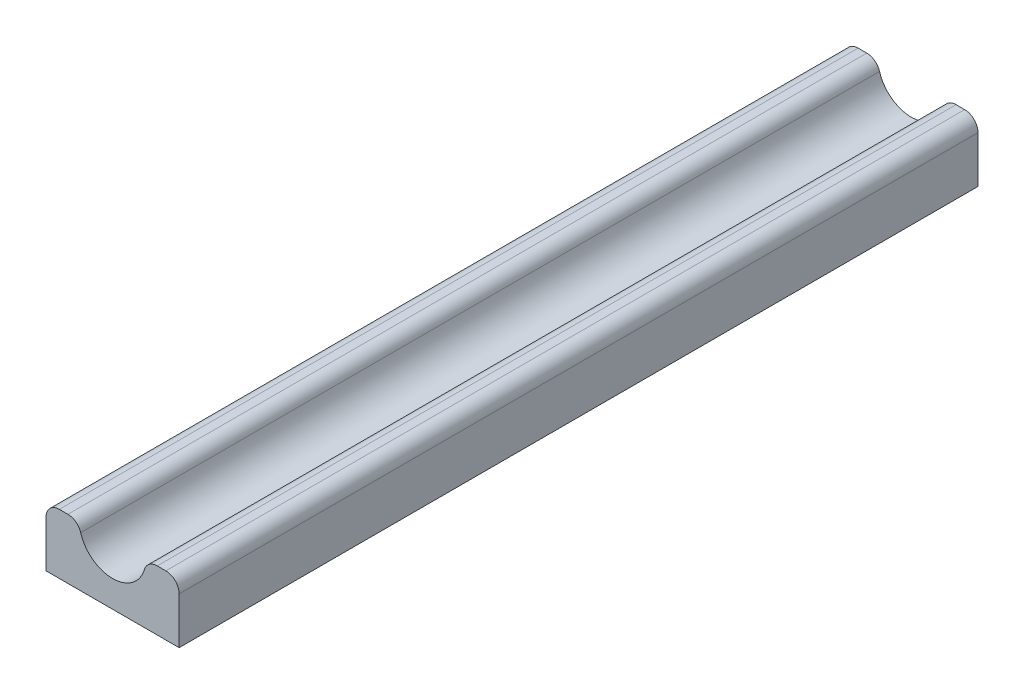
ISO-10303-21;
HEADER;
FILE_DESCRIPTION(('STEP AP214'),'2;1');
FILE_NAME('part.step','',(''),(''),'','','');
FILE_SCHEMA(('AUTOMOTIVE_DESIGN { 1 0 10303 214 1 1 1 1 }'));
ENDSEC;
DATA;
#1=APPLICATION_CONTEXT('core data for automotive mechanical design processes');
#2=APPLICATION_PROTOCOL_DEFINITION('international standard','automotive_design',2000,#1);
#3=PRODUCT_CONTEXT('',#1,'mechanical');
#4=PRODUCT('Part','Part','',(#3));
#5=PRODUCT_RELATED_PRODUCT_CATEGORY('part','',(#4));
#6=PRODUCT_DEFINITION_FORMATION('','',#4);
#7=PRODUCT_DEFINITION_CONTEXT('part definition',#1,'design');
#8=PRODUCT_DEFINITION('design','',#6,#7);
#9=PRODUCT_DEFINITION_SHAPE('','',#8);
#10=(LENGTH_UNIT() NAMED_UNIT(*) SI_UNIT(.MILLI.,.METRE.));
#11=(NAMED_UNIT(*) PLANE_ANGLE_UNIT() SI_UNIT($,.RADIAN.));
#12=(NAMED_UNIT(*) SI_UNIT($,.STERADIAN.) SOLID_ANGLE_UNIT());
#13=UNCERTAINTY_MEASURE_WITH_UNIT(LENGTH_MEASURE(1.E-05),#10,'distance_accuracy_value','');
#14=(GEOMETRIC_REPRESENTATION_CONTEXT(3) GLOBAL_UNCERTAINTY_ASSIGNED_CONTEXT((#13)) GLOBAL_UNIT_ASSIGNED_CONTEXT((#10,
#11,#12)) REPRESENTATION_CONTEXT('',''));
#15=CARTESIAN_POINT('',(0.,0.,0.));
#16=DIRECTION('',(0.,0.,1.));
#17=DIRECTION('',(1.,0.,0.));
#18=AXIS2_PLACEMENT_3D('',#15,#16,#17);
#19=CARTESIAN_POINT('',(25.,0.,300.));
#20=DIRECTION('',(-1.,0.,0.));
#21=DIRECTION('',(0.,-1.,0.));
#22=AXIS2_PLACEMENT_3D('',#19,#20,#21);
#23=PLANE('',#22);
#24=DIRECTION('',(0.,1.,0.));
#25=VECTOR('',#24,1.);
#26=CARTESIAN_POINT('',(25.,0.,0.));
#27=LINE('',#26,#25);
#28=CARTESIAN_POINT('',(25.,0.,0.));
#29=VERTEX_POINT('',#28);
#30=CARTESIAN_POINT('',(25.,17.5,0.));
#31=VERTEX_POINT('',#30);
#32=EDGE_CURVE('E143',#29,#31,#27,.T.);
#33=ORIENTED_EDGE('',*,*,#32,.T.);
#34=DIRECTION('',(0.,0.,-1.));
#35=VECTOR('',#34,1.);
#36=CARTESIAN_POINT('',(25.,17.5,300.));
#37=LINE('',#36,#35);
#38=CARTESIAN_POINT('',(25.,17.5,300.));
#39=VERTEX_POINT('',#38);
#40=EDGE_CURVE('E11',#39,#31,#37,.T.);
#41=ORIENTED_EDGE('',*,*,#40,.F.);
#42=DIRECTION('',(0.,1.,0.));
#43=VECTOR('',#42,1.);
#44=CARTESIAN_POINT('',(25.,0.,300.));
#45=LINE('',#44,#43);
#46=CARTESIAN_POINT('',(25.,0.,300.));
#47=VERTEX_POINT('',#46);
#48=EDGE_CURVE('E161',#47,#39,#45,.T.);
#49=ORIENTED_EDGE('',*,*,#48,.F.);
#50=DIRECTION('',(0.,0.,-1.));
#51=VECTOR('',#50,1.);
#52=CARTESIAN_POINT('',(25.,0.,300.));
#53=LINE('',#52,#51);
#54=EDGE_CURVE('E139',#47,#29,#53,.T.);
#55=ORIENTED_EDGE('',*,*,#54,.T.);
#56=EDGE_LOOP('',(#33,#41,#49,#55));
#57=FACE_BOUND('',#56,.T.);
#58=ADVANCED_FACE('F35',(#57),#23,.F.);
#59=CARTESIAN_POINT('',(20.,17.5,300.));
#60=DIRECTION('',(0.,0.,-1.));
#61=DIRECTION('',(-1.,0.,0.));
#62=AXIS2_PLACEMENT_3D('',#59,#60,#61);
#63=CYLINDRICAL_SURFACE('',#62,5.);
#64=CARTESIAN_POINT('',(20.,17.5,0.));
#65=DIRECTION('',(0.,0.,1.));
#66=DIRECTION('',(1.,0.,0.));
#67=AXIS2_PLACEMENT_3D('',#64,#65,#66);
#68=CIRCLE('',#67,5.);
#69=CARTESIAN_POINT('',(20.,22.5,0.));
#70=VERTEX_POINT('',#69);
#71=EDGE_CURVE('E146',#31,#70,#68,.T.);
#72=ORIENTED_EDGE('',*,*,#71,.T.);
#73=DIRECTION('',(0.,0.,-1.));
#74=VECTOR('',#73,1.);
#75=CARTESIAN_POINT('',(20.,22.5,300.));
#76=LINE('',#75,#74);
#77=CARTESIAN_POINT('',(20.,22.5,300.));
#78=VERTEX_POINT('',#77);
#79=EDGE_CURVE('E43',#78,#70,#76,.T.);
#80=ORIENTED_EDGE('',*,*,#79,.F.);
#81=CARTESIAN_POINT('',(20.,17.5,300.));
#82=DIRECTION('',(0.,0.,1.));
#83=DIRECTION('',(1.,0.,0.));
#84=AXIS2_PLACEMENT_3D('',#81,#82,#83);
#85=CIRCLE('',#84,5.);
#86=EDGE_CURVE('E100',#39,#78,#85,.T.);
#87=ORIENTED_EDGE('',*,*,#86,.F.);
#88=ORIENTED_EDGE('',*,*,#40,.T.);
#89=EDGE_LOOP('',(#72,#80,#87,#88));
#90=FACE_BOUND('',#89,.T.);
#91=ADVANCED_FACE('F210',(#90),#63,.T.);
#92=CARTESIAN_POINT('',(20.,22.5,300.));
#93=DIRECTION('',(0.,-1.,0.));
#94=DIRECTION('',(1.,0.,0.));
#95=AXIS2_PLACEMENT_3D('',#92,#93,#94);
#96=PLANE('',#95);
#97=DIRECTION('',(-1.,0.,0.));
#98=VECTOR('',#97,1.);
#99=CARTESIAN_POINT('',(20.,22.5,0.));
#100=LINE('',#99,#98);
#101=CARTESIAN_POINT('',(16.7705098312484,22.5,0.));
#102=VERTEX_POINT('',#101);
#103=EDGE_CURVE('E148',#70,#102,#100,.T.);
#104=ORIENTED_EDGE('',*,*,#103,.T.);
#105=DIRECTION('',(0.,0.,-1.));
#106=VECTOR('',#105,1.);
#107=CARTESIAN_POINT('',(16.7705098312484,22.5,300.));
#108=LINE('',#107,#106);
#109=CARTESIAN_POINT('',(16.7705098312484,22.5,300.));
#110=VERTEX_POINT('',#109);
#111=EDGE_CURVE('E174',#110,#102,#108,.T.);
#112=ORIENTED_EDGE('',*,*,#111,.F.);
#113=DIRECTION('',(-1.,0.,0.));
#114=VECTOR('',#113,1.);
#115=CARTESIAN_POINT('',(20.,22.5,300.));
#116=LINE('',#115,#114);
#117=EDGE_CURVE('E182',#78,#110,#116,.T.);
#118=ORIENTED_EDGE('',*,*,#117,.F.);
#119=ORIENTED_EDGE('',*,*,#79,.T.);
#120=EDGE_LOOP('',(#104,#112,#118,#119));
#121=FACE_BOUND('',#120,.T.);
#122=ADVANCED_FACE('F180',(#121),#96,.F.);
#123=CARTESIAN_POINT('',(16.7705098312484,17.5,300.));
#124=DIRECTION('',(0.,0.,-1.));
#125=DIRECTION('',(-1.,0.,0.));
#126=AXIS2_PLACEMENT_3D('',#123,#124,#125);
#127=CYLINDRICAL_SURFACE('',#126,5.);
#128=CARTESIAN_POINT('',(16.7705098312484,17.5,0.));
#129=DIRECTION('',(0.,0.,1.));
#130=DIRECTION('',(1.,0.,0.));
#131=AXIS2_PLACEMENT_3D('',#128,#129,#130);
#132=CIRCLE('',#131,5.);
#133=CARTESIAN_POINT('',(11.9789355937489,18.9285714285714,0.));
#134=VERTEX_POINT('',#133);
#135=EDGE_CURVE('E150',#102,#134,#132,.T.);
#136=ORIENTED_EDGE('',*,*,#135,.T.);
#137=DIRECTION('',(0.,0.,-1.));
#138=VECTOR('',#137,1.);
#139=CARTESIAN_POINT('',(11.9789355937489,18.9285714285714,300.));
#140=LINE('',#139,#138);
#141=CARTESIAN_POINT('',(11.9789355937489,18.9285714285714,300.));
#142=VERTEX_POINT('',#141);
#143=EDGE_CURVE('E171',#142,#134,#140,.T.);
#144=ORIENTED_EDGE('',*,*,#143,.F.);
#145=CARTESIAN_POINT('',(16.7705098312484,17.5,300.));
#146=DIRECTION('',(0.,0.,1.));
#147=DIRECTION('',(1.,0.,0.));
#148=AXIS2_PLACEMENT_3D('',#145,#146,#147);
#149=CIRCLE('',#148,5.);
#150=EDGE_CURVE('E200',#110,#142,#149,.T.);
#151=ORIENTED_EDGE('',*,*,#150,.F.);
#152=ORIENTED_EDGE('',*,*,#111,.T.);
#153=EDGE_LOOP('',(#136,#144,#151,#152));
#154=FACE_BOUND('',#153,.T.);
#155=ADVANCED_FACE('F191',(#154),#127,.T.);
#156=CARTESIAN_POINT('',(0.,22.5,300.));
#157=DIRECTION('',(0.,0.,-1.));
#158=DIRECTION('',(-1.,0.,0.));
#159=AXIS2_PLACEMENT_3D('',#156,#157,#158);
#160=CYLINDRICAL_SURFACE('',#159,12.5);
#161=CARTESIAN_POINT('',(0.,22.5,0.));
#162=DIRECTION('',(0.,0.,-1.));
#163=DIRECTION('',(1.,0.,0.));
#164=AXIS2_PLACEMENT_3D('',#161,#162,#163);
#165=CIRCLE('',#164,12.5);
#166=CARTESIAN_POINT('',(-11.9789355937489,18.9285714285714,0.));
#167=VERTEX_POINT('',#166);
#168=EDGE_CURVE('E152',#134,#167,#165,.T.);
#169=ORIENTED_EDGE('',*,*,#168,.T.);
#170=DIRECTION('',(0.,0.,-1.));
#171=VECTOR('',#170,1.);
#172=CARTESIAN_POINT('',(-11.9789355937489,18.9285714285714,300.));
#173=LINE('',#172,#171);
#174=CARTESIAN_POINT('',(-11.9789355937489,18.9285714285714,300.));
#175=VERTEX_POINT('',#174);
#176=EDGE_CURVE('E168',#175,#167,#173,.T.);
#177=ORIENTED_EDGE('',*,*,#176,.F.);
#178=CARTESIAN_POINT('',(0.,22.5,300.));
#179=DIRECTION('',(0.,0.,-1.));
#180=DIRECTION('',(1.,0.,0.));
#181=AXIS2_PLACEMENT_3D('',#178,#179,#180);
#182=CIRCLE('',#181,12.5);
#183=EDGE_CURVE('E197',#142,#175,#182,.T.);
#184=ORIENTED_EDGE('',*,*,#183,.F.);
#185=ORIENTED_EDGE('',*,*,#143,.T.);
#186=EDGE_LOOP('',(#169,#177,#184,#185));
#187=FACE_BOUND('',#186,.T.);
#188=ADVANCED_FACE('F195',(#187),#160,.F.);
#189=CARTESIAN_POINT('',(-16.7705098312484,17.5,300.));
#190=DIRECTION('',(0.,0.,-1.));
#191=DIRECTION('',(-1.,0.,0.));
#192=AXIS2_PLACEMENT_3D('',#189,#190,#191);
#193=CYLINDRICAL_SURFACE('',#192,5.);
#194=CARTESIAN_POINT('',(-16.7705098312484,17.5,0.));
#195=DIRECTION('',(0.,0.,1.));
#196=DIRECTION('',(-1.,0.,0.));
#197=AXIS2_PLACEMENT_3D('',#194,#195,#196);
#198=CIRCLE('',#197,5.);
#199=CARTESIAN_POINT('',(-16.7705098312484,22.5,0.));
#200=VERTEX_POINT('',#199);
#201=EDGE_CURVE('E154',#167,#200,#198,.T.);
#202=ORIENTED_EDGE('',*,*,#201,.T.);
#203=DIRECTION('',(0.,0.,-1.));
#204=VECTOR('',#203,1.);
#205=CARTESIAN_POINT('',(-16.7705098312484,22.5,300.));
#206=LINE('',#205,#204);
#207=CARTESIAN_POINT('',(-16.7705098312484,22.5,300.));
#208=VERTEX_POINT('',#207);
#209=EDGE_CURVE('E165',#208,#200,#206,.T.);
#210=ORIENTED_EDGE('',*,*,#209,.F.);
#211=CARTESIAN_POINT('',(-16.7705098312484,17.5,300.));
#212=DIRECTION('',(0.,0.,1.));
#213=DIRECTION('',(-1.,0.,0.));
#214=AXIS2_PLACEMENT_3D('',#211,#212,#213);
#215=CIRCLE('',#214,5.);
#216=EDGE_CURVE('E199',#175,#208,#215,.T.);
#217=ORIENTED_EDGE('',*,*,#216,.F.);
#218=ORIENTED_EDGE('',*,*,#176,.T.);
#219=EDGE_LOOP('',(#202,#210,#217,#218));
#220=FACE_BOUND('',#219,.T.);
#221=ADVANCED_FACE('F222',(#220),#193,.T.);
#222=CARTESIAN_POINT('',(-20.,22.5,300.));
#223=DIRECTION('',(0.,-1.,0.));
#224=DIRECTION('',(1.,0.,0.));
#225=AXIS2_PLACEMENT_3D('',#222,#223,#224);
#226=PLANE('',#225);
#227=DIRECTION('',(-1.,0.,0.));
#228=VECTOR('',#227,1.);
#229=CARTESIAN_POINT('',(-20.,22.5,0.));
#230=LINE('',#229,#228);
#231=CARTESIAN_POINT('',(-20.,22.5,0.));
#232=VERTEX_POINT('',#231);
#233=EDGE_CURVE('E156',#200,#232,#230,.T.);
#234=ORIENTED_EDGE('',*,*,#233,.T.);
#235=DIRECTION('',(0.,0.,-1.));
#236=VECTOR('',#235,1.);
#237=CARTESIAN_POINT('',(-20.,22.5,300.));
#238=LINE('',#237,#236);
#239=CARTESIAN_POINT('',(-20.,22.5,300.));
#240=VERTEX_POINT('',#239);
#241=EDGE_CURVE('E134',#240,#232,#238,.T.);
#242=ORIENTED_EDGE('',*,*,#241,.F.);
#243=DIRECTION('',(-1.,0.,0.));
#244=VECTOR('',#243,1.);
#245=CARTESIAN_POINT('',(-20.,22.5,300.));
#246=LINE('',#245,#244);
#247=EDGE_CURVE('E125',#208,#240,#246,.T.);
#248=ORIENTED_EDGE('',*,*,#247,.F.);
#249=ORIENTED_EDGE('',*,*,#209,.T.);
#250=EDGE_LOOP('',(#234,#242,#248,#249));
#251=FACE_BOUND('',#250,.T.);
#252=ADVANCED_FACE('F225',(#251),#226,.F.);
#253=CARTESIAN_POINT('',(-20.,17.5,300.));
#254=DIRECTION('',(0.,0.,-1.));
#255=DIRECTION('',(-1.,0.,0.));
#256=AXIS2_PLACEMENT_3D('',#253,#254,#255);
#257=CYLINDRICAL_SURFACE('',#256,5.);
#258=CARTESIAN_POINT('',(-20.,17.5,0.));
#259=DIRECTION('',(0.,0.,1.));
#260=DIRECTION('',(-1.,0.,0.));
#261=AXIS2_PLACEMENT_3D('',#258,#259,#260);
#262=CIRCLE('',#261,5.);
#263=CARTESIAN_POINT('',(-25.,17.5,0.));
#264=VERTEX_POINT('',#263);
#265=EDGE_CURVE('E133',#232,#264,#262,.T.);
#266=ORIENTED_EDGE('',*,*,#265,.T.);
#267=DIRECTION('',(0.,0.,-1.));
#268=VECTOR('',#267,1.);
#269=CARTESIAN_POINT('',(-25.,17.5,300.));
#270=LINE('',#269,#268);
#271=CARTESIAN_POINT('',(-25.,17.5,300.));
#272=VERTEX_POINT('',#271);
#273=EDGE_CURVE('E130',#272,#264,#270,.T.);
#274=ORIENTED_EDGE('',*,*,#273,.F.);
#275=CARTESIAN_POINT('',(-20.,17.5,300.));
#276=DIRECTION('',(0.,0.,1.));
#277=DIRECTION('',(-1.,0.,0.));
#278=AXIS2_PLACEMENT_3D('',#275,#276,#277);
#279=CIRCLE('',#278,5.);
#280=EDGE_CURVE('E119',#240,#272,#279,.T.);
#281=ORIENTED_EDGE('',*,*,#280,.F.);
#282=ORIENTED_EDGE('',*,*,#241,.T.);
#283=EDGE_LOOP('',(#266,#274,#281,#282));
#284=FACE_BOUND('',#283,.T.);
#285=ADVANCED_FACE('F131',(#284),#257,.T.);
#286=CARTESIAN_POINT('',(-25.,0.,300.));
#287=DIRECTION('',(1.,0.,0.));
#288=DIRECTION('',(0.,1.,0.));
#289=AXIS2_PLACEMENT_3D('',#286,#287,#288);
#290=PLANE('',#289);
#291=DIRECTION('',(0.,-1.,0.));
#292=VECTOR('',#291,1.);
#293=CARTESIAN_POINT('',(-25.,0.,0.));
#294=LINE('',#293,#292);
#295=CARTESIAN_POINT('',(-25.,0.,0.));
#296=VERTEX_POINT('',#295);
#297=EDGE_CURVE('E86',#264,#296,#294,.T.);
#298=ORIENTED_EDGE('',*,*,#297,.T.);
#299=DIRECTION('',(0.,0.,-1.));
#300=VECTOR('',#299,1.);
#301=CARTESIAN_POINT('',(-25.,0.,300.));
#302=LINE('',#301,#300);
#303=CARTESIAN_POINT('',(-25.,0.,300.));
#304=VERTEX_POINT('',#303);
#305=EDGE_CURVE('E135',#304,#296,#302,.T.);
#306=ORIENTED_EDGE('',*,*,#305,.F.);
#307=DIRECTION('',(0.,-1.,0.));
#308=VECTOR('',#307,1.);
#309=CARTESIAN_POINT('',(-25.,0.,300.));
#310=LINE('',#309,#308);
#311=EDGE_CURVE('E123',#272,#304,#310,.T.);
#312=ORIENTED_EDGE('',*,*,#311,.F.);
#313=ORIENTED_EDGE('',*,*,#273,.T.);
#314=EDGE_LOOP('',(#298,#306,#312,#313));
#315=FACE_BOUND('',#314,.T.);
#316=ADVANCED_FACE('F137',(#315),#290,.F.);
#317=CARTESIAN_POINT('',(-25.,0.,300.));
#318=DIRECTION('',(0.,1.,0.));
#319=DIRECTION('',(-1.,0.,0.));
#320=AXIS2_PLACEMENT_3D('',#317,#318,#319);
#321=PLANE('',#320);
#322=DIRECTION('',(1.,0.,0.));
#323=VECTOR('',#322,1.);
#324=CARTESIAN_POINT('',(-25.,0.,0.));
#325=LINE('',#324,#323);
#326=EDGE_CURVE('E92',#296,#29,#325,.T.);
#327=ORIENTED_EDGE('',*,*,#326,.T.);
#328=ORIENTED_EDGE('',*,*,#54,.F.);
#329=DIRECTION('',(1.,0.,0.));
#330=VECTOR('',#329,1.);
#331=CARTESIAN_POINT('',(-25.,0.,300.));
#332=LINE('',#331,#330);
#333=EDGE_CURVE('E51',#304,#47,#332,.T.);
#334=ORIENTED_EDGE('',*,*,#333,.F.);
#335=ORIENTED_EDGE('',*,*,#305,.T.);
#336=EDGE_LOOP('',(#327,#328,#334,#335));
#337=FACE_BOUND('',#336,.T.);
#338=ADVANCED_FACE('F234',(#337),#321,.F.);
#339=CARTESIAN_POINT('',(20.,17.5,300.));
#340=DIRECTION('',(0.,0.,1.));
#341=DIRECTION('',(1.,0.,0.));
#342=AXIS2_PLACEMENT_3D('',#339,#340,#341);
#343=PLANE('',#342);
#344=ORIENTED_EDGE('',*,*,#48,.T.);
#345=ORIENTED_EDGE('',*,*,#86,.T.);
#346=ORIENTED_EDGE('',*,*,#117,.T.);
#347=ORIENTED_EDGE('',*,*,#150,.T.);
#348=ORIENTED_EDGE('',*,*,#183,.T.);
#349=ORIENTED_EDGE('',*,*,#216,.T.);
#350=ORIENTED_EDGE('',*,*,#247,.T.);
#351=ORIENTED_EDGE('',*,*,#280,.T.);
#352=ORIENTED_EDGE('',*,*,#311,.T.);
#353=ORIENTED_EDGE('',*,*,#333,.T.);
#354=EDGE_LOOP('',(#344,#345,#346,#347,#348,#349,#350,#351,#352,#353));
#355=FACE_BOUND('',#354,.T.);
#356=ADVANCED_FACE('F121',(#355),#343,.T.);
#357=CARTESIAN_POINT('',(20.,17.5,0.));
#358=DIRECTION('',(0.,0.,1.));
#359=DIRECTION('',(1.,0.,0.));
#360=AXIS2_PLACEMENT_3D('',#357,#358,#359);
#361=PLANE('',#360);
#362=ORIENTED_EDGE('',*,*,#32,.F.);
#363=ORIENTED_EDGE('',*,*,#326,.F.);
#364=ORIENTED_EDGE('',*,*,#297,.F.);
#365=ORIENTED_EDGE('',*,*,#265,.F.);
#366=ORIENTED_EDGE('',*,*,#233,.F.);
#367=ORIENTED_EDGE('',*,*,#201,.F.);
#368=ORIENTED_EDGE('',*,*,#168,.F.);
#369=ORIENTED_EDGE('',*,*,#135,.F.);
#370=ORIENTED_EDGE('',*,*,#103,.F.);
#371=ORIENTED_EDGE('',*,*,#71,.F.);
#372=EDGE_LOOP('',(#362,#363,#364,#365,#366,#367,#368,#369,#370,#371));
#373=FACE_BOUND('',#372,.T.);
#374=ADVANCED_FACE('F186',(#373),#361,.F.);
#375=CLOSED_SHELL('',(#58,#91,#122,#155,#188,#221,#252,#285,#316,#338,#356,#374));
#376=MANIFOLD_SOLID_BREP('B2',#375);
#377=ADVANCED_BREP_SHAPE_REPRESENTATION('',(#18,#376),#14);
#378=SHAPE_DEFINITION_REPRESENTATION(#9,#377);
ENDSEC;
END-ISO-10303-21;
